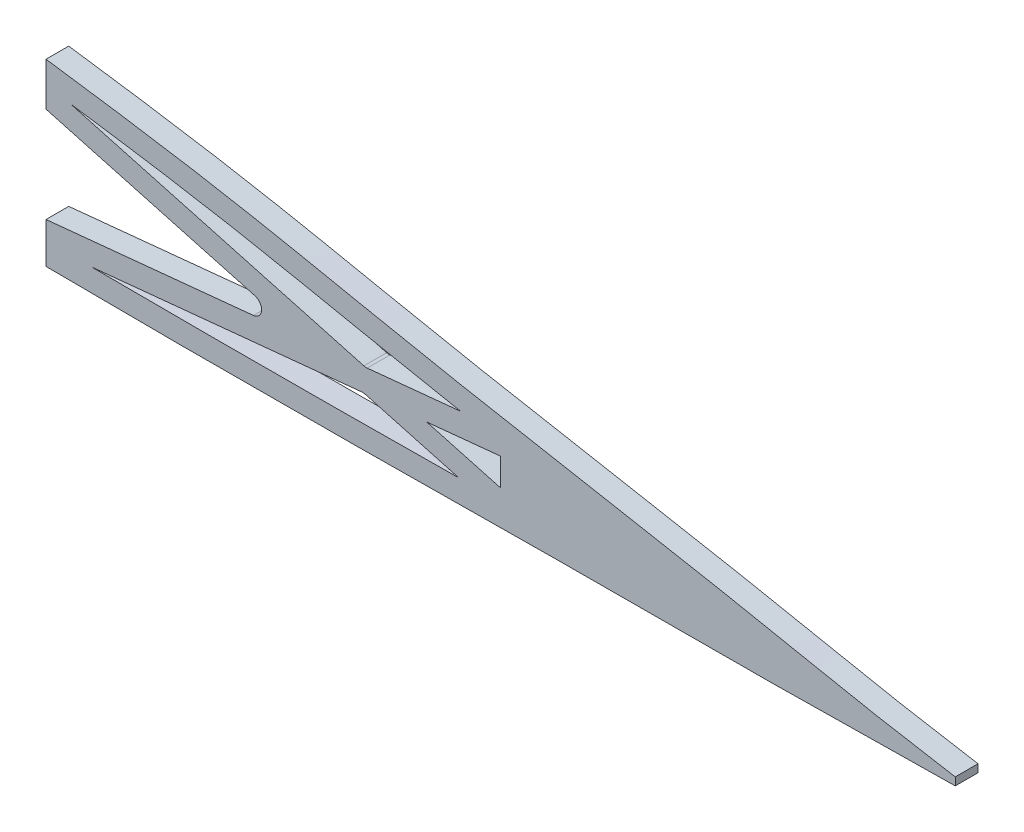
ISO-10303-21;
HEADER;
FILE_DESCRIPTION(('STEP AP214'),'2;1');
FILE_NAME('part.step','',(''),(''),'','','');
FILE_SCHEMA(('AUTOMOTIVE_DESIGN { 1 0 10303 214 1 1 1 1 }'));
ENDSEC;
DATA;
#1=APPLICATION_CONTEXT('core data for automotive mechanical design processes');
#2=APPLICATION_PROTOCOL_DEFINITION('international standard','automotive_design',2000,#1);
#3=PRODUCT_CONTEXT('',#1,'mechanical');
#4=PRODUCT('Part','Part','',(#3));
#5=PRODUCT_RELATED_PRODUCT_CATEGORY('part','',(#4));
#6=PRODUCT_DEFINITION_FORMATION('','',#4);
#7=PRODUCT_DEFINITION_CONTEXT('part definition',#1,'design');
#8=PRODUCT_DEFINITION('design','',#6,#7);
#9=PRODUCT_DEFINITION_SHAPE('','',#8);
#10=(LENGTH_UNIT() NAMED_UNIT(*) SI_UNIT(.MILLI.,.METRE.));
#11=(NAMED_UNIT(*) PLANE_ANGLE_UNIT() SI_UNIT($,.RADIAN.));
#12=(NAMED_UNIT(*) SI_UNIT($,.STERADIAN.) SOLID_ANGLE_UNIT());
#13=UNCERTAINTY_MEASURE_WITH_UNIT(LENGTH_MEASURE(1.E-05),#10,'distance_accuracy_value','');
#14=(GEOMETRIC_REPRESENTATION_CONTEXT(3) GLOBAL_UNCERTAINTY_ASSIGNED_CONTEXT((#13)) GLOBAL_UNIT_ASSIGNED_CONTEXT((#10,
#11,#12)) REPRESENTATION_CONTEXT('',''));
#15=CARTESIAN_POINT('',(0.,0.,0.));
#16=DIRECTION('',(0.,0.,1.));
#17=DIRECTION('',(1.,0.,0.));
#18=AXIS2_PLACEMENT_3D('',#15,#16,#17);
#19=CARTESIAN_POINT('',(200.,0.,0.));
#20=DIRECTION('',(1.,0.,0.));
#21=DIRECTION('',(0.,0.,-1.));
#22=AXIS2_PLACEMENT_3D('',#19,#20,#21);
#23=PLANE('',#22);
#24=DIRECTION('',(0.,1.,0.));
#25=VECTOR('',#24,1.);
#26=CARTESIAN_POINT('',(200.,7.043837586024,5.));
#27=LINE('',#26,#25);
#28=CARTESIAN_POINT('',(200.,-1.90770409103727,5.));
#29=VERTEX_POINT('',#28);
#30=CARTESIAN_POINT('',(200.,7.03924509381721,5.));
#31=VERTEX_POINT('',#30);
#32=EDGE_CURVE('E330',#29,#31,#27,.T.);
#33=ORIENTED_EDGE('',*,*,#32,.T.);
#34=DIRECTION('',(0.,0.,-1.));
#35=VECTOR('',#34,1.);
#36=CARTESIAN_POINT('',(200.,7.03924509381721,0.));
#37=LINE('',#36,#35);
#38=CARTESIAN_POINT('',(200.,7.03924509381721,0.));
#39=VERTEX_POINT('',#38);
#40=EDGE_CURVE('E40',#31,#39,#37,.T.);
#41=ORIENTED_EDGE('',*,*,#40,.T.);
#42=DIRECTION('',(0.,1.,0.));
#43=VECTOR('',#42,1.);
#44=CARTESIAN_POINT('',(200.,7.043837586024,0.));
#45=LINE('',#44,#43);
#46=CARTESIAN_POINT('',(200.,-1.90770409103727,0.));
#47=VERTEX_POINT('',#46);
#48=EDGE_CURVE('E327',#47,#39,#45,.T.);
#49=ORIENTED_EDGE('',*,*,#48,.F.);
#50=DIRECTION('',(0.,0.,-1.));
#51=VECTOR('',#50,1.);
#52=CARTESIAN_POINT('',(200.,-1.90770409103727,5.));
#53=LINE('',#52,#51);
#54=EDGE_CURVE('E35',#29,#47,#53,.T.);
#55=ORIENTED_EDGE('',*,*,#54,.F.);
#56=EDGE_LOOP('',(#33,#41,#49,#55));
#57=FACE_BOUND('',#56,.T.);
#58=ADVANCED_FACE('F32',(#57),#23,.F.);
#59=CARTESIAN_POINT('',(200.,28.0530698130534,0.));
#60=VERTEX_POINT('',#59);
#61=CARTESIAN_POINT('',(199.999999980524,37.5711893939418,0.));
#62=VERTEX_POINT('',#61);
#63=EDGE_CURVE('E325',#60,#62,#45,.T.);
#64=ORIENTED_EDGE('',*,*,#63,.F.);
#65=DIRECTION('',(0.,0.,1.));
#66=VECTOR('',#65,1.);
#67=CARTESIAN_POINT('',(200.,28.0530698130534,0.));
#68=LINE('',#67,#66);
#69=CARTESIAN_POINT('',(200.,28.0530698130534,5.));
#70=VERTEX_POINT('',#69);
#71=EDGE_CURVE('E11',#60,#70,#68,.T.);
#72=ORIENTED_EDGE('',*,*,#71,.T.);
#73=CARTESIAN_POINT('',(199.999999980524,37.5711893939418,5.));
#74=VERTEX_POINT('',#73);
#75=EDGE_CURVE('E54',#70,#74,#27,.T.);
#76=ORIENTED_EDGE('',*,*,#75,.T.);
#77=DIRECTION('',(0.,0.,-1.));
#78=VECTOR('',#77,1.);
#79=CARTESIAN_POINT('',(200.,37.571189391213,5.));
#80=LINE('',#79,#78);
#81=EDGE_CURVE('E331',#62,#74,#80,.F.);
#82=ORIENTED_EDGE('',*,*,#81,.F.);
#83=EDGE_LOOP('',(#64,#72,#76,#82));
#84=FACE_BOUND('',#83,.T.);
#85=ADVANCED_FACE('F400',(#84),#23,.F.);
#86=CARTESIAN_POINT('',(400.,0.86,5.));
#87=CARTESIAN_POINT('',(393.305200969761,1.99142755040669,5.));
#88=CARTESIAN_POINT('',(379.888054219409,4.25893840661478,5.));
#89=CARTESIAN_POINT('',(353.254467592909,9.83498405388175,5.));
#90=CARTESIAN_POINT('',(319.778282362921,15.9016990449285,5.));
#91=CARTESIAN_POINT('',(279.606581657055,23.2215104734732,5.));
#92=CARTESIAN_POINT('',(239.749084042503,31.8228169360915,5.));
#93=CARTESIAN_POINT('',(199.582528596392,37.7218975615089,5.));
#94=CARTESIAN_POINT('',(159.575958445031,43.0450651023344,5.));
#95=CARTESIAN_POINT('',(119.38948583214,43.2860222284759,5.));
#96=CARTESIAN_POINT('',(85.9323003627734,41.5114784156984,5.));
#97=CARTESIAN_POINT('',(59.3734981217757,37.1058365434409,5.));
#98=CARTESIAN_POINT('',(42.4639414852355,33.5766206109549,5.));
#99=CARTESIAN_POINT('',(29.3854656327509,27.8637243258005,5.));
#100=CARTESIAN_POINT('',(19.3178187984093,22.4722217471976,5.));
#101=CARTESIAN_POINT('',(10.8827558349478,16.3887875669979,5.));
#102=CARTESIAN_POINT('',(3.93495223261592,9.56118653744447,5.));
#103=CARTESIAN_POINT('',(-2.75756496559743,1.03970412367404,5.));
#104=CARTESIAN_POINT('',(4.17555573954822,-6.01546626962182,5.));
#105=CARTESIAN_POINT('',(11.7526832410801,-6.40289821774636,5.));
#106=CARTESIAN_POINT('',(20.0895265549785,-5.97846616902742,5.));
#107=CARTESIAN_POINT('',(30.0691693906292,-5.11730792526454,5.));
#108=CARTESIAN_POINT('',(43.3831845646684,-4.18369625072396,5.));
#109=CARTESIAN_POINT('',(60.0439860951753,-3.42405578167953,5.));
#110=CARTESIAN_POINT('',(86.6955135899485,-2.40177217003834,5.));
#111=CARTESIAN_POINT('',(120.021494479284,-1.64515397548607,5.));
#112=CARTESIAN_POINT('',(160.025517699974,-1.28235968805552,5.));
#113=CARTESIAN_POINT('',(200.023820480916,-2.00949740140305,5.));
#114=CARTESIAN_POINT('',(240.02816442434,-2.12748366445573,5.));
#115=CARTESIAN_POINT('',(280.026138396921,-1.93656875711633,5.));
#116=CARTESIAN_POINT('',(320.021358669628,-1.40635764751217,5.));
#117=CARTESIAN_POINT('',(353.35376652875,-1.57269368552499,5.));
#118=CARTESIAN_POINT('',(380.011903847922,-1.12398479042677,5.));
#119=CARTESIAN_POINT('',(393.338634368235,-0.947977323947112,5.));
#120=CARTESIAN_POINT('',(400.,-0.86,5.));
#121=B_SPLINE_CURVE_WITH_KNOTS('',3,(#86,#87,#88,#89,#90,#91,#92,#93,#94,#95,#96,#97,#98,#99,
#100,#101,#102,#103,#104,#105,#106,#107,#108,#109,#110,#111,#112,#113,#114,#115,#116,#117,#118,
#119,#120),.UNSPECIFIED.,.F.,.F.,(4,1,1,1,1,1,1,1,1,1,1,1,1,1,1,1,1,1,1,1,1,1,1,1,1,1,1,1,1,1,1,
1,4),(0.,0.0248295773829765,0.0497613269631987,0.0995049965705522,0.149248666177906,
0.199103599981432,0.248559965552503,0.297717772308088,0.346503417595012,0.395330606156916,
0.419968930729442,0.445007851211111,0.458170616036537,0.471959979106409,0.486919665832551,
0.495371230052362,0.509218186986135,0.518334927016012,0.524512280228655,0.53670542331738,
0.548918460827883,0.561124671111155,0.585522220066046,0.609906958704101,0.658670148191845,
0.707430288578332,0.756206934016985,0.804971253367168,0.853735728028721,0.902491752984366,
0.951255847290666,0.975635237531629,1.),.UNSPECIFIED.);
#122=DIRECTION('',(0.,0.,-1.));
#123=VECTOR('',#122,1.);
#124=SURFACE_OF_LINEAR_EXTRUSION('',#121,#123);
#125=CARTESIAN_POINT('',(400.,0.86,0.));
#126=CARTESIAN_POINT('',(393.305200969761,1.99142755040669,0.));
#127=CARTESIAN_POINT('',(379.888054219409,4.25893840661478,0.));
#128=CARTESIAN_POINT('',(353.254467592909,9.83498405388175,0.));
#129=CARTESIAN_POINT('',(319.778282362921,15.9016990449285,0.));
#130=CARTESIAN_POINT('',(279.606581657055,23.2215104734732,0.));
#131=CARTESIAN_POINT('',(239.749084042503,31.8228169360915,0.));
#132=CARTESIAN_POINT('',(199.582528596392,37.7218975615089,0.));
#133=CARTESIAN_POINT('',(159.575958445031,43.0450651023344,0.));
#134=CARTESIAN_POINT('',(119.38948583214,43.2860222284759,0.));
#135=CARTESIAN_POINT('',(85.9323003627734,41.5114784156984,0.));
#136=CARTESIAN_POINT('',(59.3734981217757,37.1058365434409,0.));
#137=CARTESIAN_POINT('',(42.4639414852355,33.5766206109549,0.));
#138=CARTESIAN_POINT('',(29.3854656327509,27.8637243258005,0.));
#139=CARTESIAN_POINT('',(19.3178187984093,22.4722217471976,0.));
#140=CARTESIAN_POINT('',(10.8827558349478,16.3887875669979,0.));
#141=CARTESIAN_POINT('',(3.93495223261592,9.56118653744447,0.));
#142=CARTESIAN_POINT('',(-2.75756496559743,1.03970412367404,0.));
#143=CARTESIAN_POINT('',(4.17555573954822,-6.01546626962182,0.));
#144=CARTESIAN_POINT('',(11.7526832410801,-6.40289821774636,0.));
#145=CARTESIAN_POINT('',(20.0895265549785,-5.97846616902742,0.));
#146=CARTESIAN_POINT('',(30.0691693906292,-5.11730792526454,0.));
#147=CARTESIAN_POINT('',(43.3831845646684,-4.18369625072396,0.));
#148=CARTESIAN_POINT('',(60.0439860951753,-3.42405578167953,0.));
#149=CARTESIAN_POINT('',(86.6955135899485,-2.40177217003834,0.));
#150=CARTESIAN_POINT('',(120.021494479284,-1.64515397548607,0.));
#151=CARTESIAN_POINT('',(160.025517699974,-1.28235968805552,0.));
#152=CARTESIAN_POINT('',(200.023820480916,-2.00949740140305,0.));
#153=CARTESIAN_POINT('',(240.02816442434,-2.12748366445573,0.));
#154=CARTESIAN_POINT('',(280.026138396921,-1.93656875711633,0.));
#155=CARTESIAN_POINT('',(320.021358669628,-1.40635764751217,0.));
#156=CARTESIAN_POINT('',(353.35376652875,-1.57269368552499,0.));
#157=CARTESIAN_POINT('',(380.011903847922,-1.12398479042677,0.));
#158=CARTESIAN_POINT('',(393.338634368235,-0.947977323947112,0.));
#159=CARTESIAN_POINT('',(400.,-0.86,0.));
#160=B_SPLINE_CURVE_WITH_KNOTS('',3,(#125,#126,#127,#128,#129,#130,#131,#132,#133,#134,#135,
#136,#137,#138,#139,#140,#141,#142,#143,#144,#145,#146,#147,#148,#149,#150,#151,#152,#153,#154,
#155,#156,#157,#158,#159),.UNSPECIFIED.,.F.,.F.,(4,1,1,1,1,1,1,1,1,1,1,1,1,1,1,1,1,1,1,1,1,1,1,
1,1,1,1,1,1,1,1,1,4),(0.,0.0248295773829765,0.0497613269631987,0.0995049965705522,
0.149248666177906,0.199103599981432,0.248559965552503,0.297717772308088,0.346503417595012,
0.395330606156916,0.419968930729442,0.445007851211111,0.458170616036537,0.471959979106409,
0.486919665832551,0.495371230052362,0.509218186986135,0.518334927016012,0.524512280228655,
0.53670542331738,0.548918460827883,0.561124671111155,0.585522220066046,0.609906958704101,
0.658670148191845,0.707430288578332,0.756206934016985,0.804971253367168,0.853735728028721,
0.902491752984366,0.951255847290666,0.975635237531629,1.),.UNSPECIFIED.);
#161=CARTESIAN_POINT('',(400.,0.86,0.));
#162=VERTEX_POINT('',#161);
#163=EDGE_CURVE('E273',#162,#62,#160,.T.);
#164=ORIENTED_EDGE('',*,*,#163,.T.);
#165=ORIENTED_EDGE('',*,*,#81,.T.);
#166=CARTESIAN_POINT('',(400.,0.86,5.));
#167=VERTEX_POINT('',#166);
#168=EDGE_CURVE('E259',#167,#74,#121,.T.);
#169=ORIENTED_EDGE('',*,*,#168,.F.);
#170=DIRECTION('',(0.,0.,-1.));
#171=VECTOR('',#170,1.);
#172=CARTESIAN_POINT('',(400.,0.86,5.));
#173=LINE('',#172,#171);
#174=EDGE_CURVE('E272',#167,#162,#173,.T.);
#175=ORIENTED_EDGE('',*,*,#174,.T.);
#176=EDGE_LOOP('',(#164,#165,#169,#175));
#177=FACE_BOUND('',#176,.T.);
#178=ADVANCED_FACE('F256',(#177),#124,.F.);
#179=CARTESIAN_POINT('',(299.035331138625,14.6268160741621,0.));
#180=CARTESIAN_POINT('',(292.682918130848,15.8093818862015,0.));
#181=CARTESIAN_POINT('',(279.986265855587,18.2216244621528,0.));
#182=CARTESIAN_POINT('',(261.001524003361,22.1361874256996,0.));
#183=CARTESIAN_POINT('',(242.147384699483,25.9336635552651,0.));
#184=CARTESIAN_POINT('',(223.262132370369,29.157945257666,0.));
#185=CARTESIAN_POINT('',(204.204026754886,31.950443940324,0.));
#186=CARTESIAN_POINT('',(185.077851194747,34.6197888598386,0.));
#187=CARTESIAN_POINT('',(166.069831520559,36.8372981966706,0.));
#188=CARTESIAN_POINT('',(147.103727780763,38.0000915465113,0.));
#189=CARTESIAN_POINT('',(127.973344322435,38.1362911760349,0.));
#190=CARTESIAN_POINT('',(108.748796247002,37.6624480648246,0.));
#191=CARTESIAN_POINT('',(92.8690039125347,36.6730460642672,0.));
#192=CARTESIAN_POINT('',(80.2916679928894,35.3040492043498,0.));
#193=CARTESIAN_POINT('',(70.9073643558579,33.9444623574548,0.));
#194=CARTESIAN_POINT('',(61.4815374215166,32.2984396693507,0.));
#195=CARTESIAN_POINT('',(52.1124028956017,30.4860674746299,0.));
#196=CARTESIAN_POINT('',(44.6787404731845,28.5551346576707,0.));
#197=CARTESIAN_POINT('',(39.0191043655183,26.5401848451985,0.));
#198=CARTESIAN_POINT('',(34.7955891399546,24.7499639340872,0.));
#199=CARTESIAN_POINT('',(30.5859005956367,22.7500753301868,0.));
#200=CARTESIAN_POINT('',(26.4921782912631,20.6211960287943,0.));
#201=CARTESIAN_POINT('',(22.5283577345136,18.3187979405783,0.));
#202=CARTESIAN_POINT('',(18.6772384215844,15.7932333571335,0.));
#203=CARTESIAN_POINT('',(15.6462403046157,13.5315432734417,0.));
#204=CARTESIAN_POINT('',(13.3836737281658,11.6517497967764,0.));
#205=CARTESIAN_POINT('',(11.7872008858886,10.2185692822072,0.));
#206=CARTESIAN_POINT('',(10.243553885479,8.71443512114425,0.));
#207=CARTESIAN_POINT('',(8.66048476506102,7.0407875568268,0.));
#208=CARTESIAN_POINT('',(7.05502488836856,5.21701068302751,0.));
#209=CARTESIAN_POINT('',(5.7669490305151,3.48490011748763,0.));
#210=CARTESIAN_POINT('',(4.9891007839833,2.00848532962692,0.));
#211=CARTESIAN_POINT('',(4.8507721100005,1.31233958024176,0.));
#212=CARTESIAN_POINT('',(4.86766038179393,1.14605635665188,0.));
#213=CARTESIAN_POINT('',(4.86410778889175,1.11169166848621,0.));
#214=CARTESIAN_POINT('',(5.16639887304542,0.465327926856741,0.));
#215=CARTESIAN_POINT('',(5.94814031811658,-0.286635423849746,0.));
#216=CARTESIAN_POINT('',(6.64870275688099,-0.722057850963071,0.));
#217=CARTESIAN_POINT('',(7.08245121952551,-0.914778801401329,0.));
#218=CARTESIAN_POINT('',(7.59992500732757,-1.06241800904831,0.));
#219=CARTESIAN_POINT('',(8.30223686090707,-1.17504510759262,0.));
#220=CARTESIAN_POINT('',(9.1808768627137,-1.23955679561765,0.));
#221=CARTESIAN_POINT('',(10.2657289159335,-1.26520660001156,0.));
#222=CARTESIAN_POINT('',(11.4123924888159,-1.27405202291556,0.));
#223=CARTESIAN_POINT('',(12.9282743791984,-1.26295888906647,0.));
#224=CARTESIAN_POINT('',(14.8440427468195,-1.21093092016361,0.));
#225=CARTESIAN_POINT('',(17.1643670405053,-1.09927037140642,0.));
#226=CARTESIAN_POINT('',(20.298544384493,-0.901176789637262,0.));
#227=CARTESIAN_POINT('',(24.2680046374866,-0.597314002796502,0.));
#228=CARTESIAN_POINT('',(29.0898589709367,-0.200210542203632,0.));
#229=CARTESIAN_POINT('',(33.955693631739,0.166807515168344,0.));
#230=CARTESIAN_POINT('',(40.4335072260625,0.603296530220523,0.));
#231=CARTESIAN_POINT('',(48.5343443356036,1.0520336934546,0.));
#232=CARTESIAN_POINT('',(58.2235870528319,1.48584263837947,0.));
#233=CARTESIAN_POINT('',(67.8940960179546,1.87964569912722,0.));
#234=CARTESIAN_POINT('',(77.5751488761833,2.23590199296134,0.));
#235=CARTESIAN_POINT('',(90.4870776539441,2.64657087938945,0.));
#236=CARTESIAN_POINT('',(106.625123431567,3.04406052156369,0.));
#237=CARTESIAN_POINT('',(125.983142294263,3.37549447127149,0.));
#238=CARTESIAN_POINT('',(145.354124554947,3.57080464900245,0.));
#239=CARTESIAN_POINT('',(164.752476969993,3.5455872320248,0.));
#240=CARTESIAN_POINT('',(184.112046368981,3.29176996306967,0.));
#241=CARTESIAN_POINT('',(203.409283461673,3.03381883213432,0.));
#242=CARTESIAN_POINT('',(222.703153334166,2.92486718063442,0.));
#243=CARTESIAN_POINT('',(242.010660857041,2.91425673971068,0.));
#244=CARTESIAN_POINT('',(261.321601831082,2.97526323476208,0.));
#245=CARTESIAN_POINT('',(280.622264812033,3.11273633685657,0.));
#246=CARTESIAN_POINT('',(293.509351287969,3.25603557291985,0.));
#247=CARTESIAN_POINT('',(299.950410362096,3.31992067247559,0.));
#248=B_SPLINE_CURVE_WITH_KNOTS('',3,(#179,#180,#181,#182,#183,#184,#185,#186,#187,#188,#189,
#190,#191,#192,#193,#194,#195,#196,#197,#198,#199,#200,#201,#202,#203,#204,#205,#206,#207,#208,
#209,#210,#211,#212,#213,#214,#215,#216,#217,#218,#219,#220,#221,#222,#223,#224,#225,#226,#227,
#228,#229,#230,#231,#232,#233,#234,#235,#236,#237,#238,#239,#240,#241,#242,#243,#244,#245,#246,
#247),.UNSPECIFIED.,.F.,.F.,(4,1,1,1,1,1,1,1,1,1,1,1,1,1,1,1,1,1,1,1,1,1,1,1,1,1,1,1,1,1,1,1,1,
1,1,1,1,1,1,1,1,1,1,1,1,1,1,1,1,1,1,1,1,1,1,1,1,1,1,1,1,1,1,1,1,1,4),(0.124081866195355,
0.14764445360149,0.171207041007624,0.194769628413758,0.218332215819892,0.241894803226026,
0.26545739063216,0.289019978038295,0.312582565444429,0.336145152850563,0.359707740256697,
0.383270327662831,0.395051621365898,0.406832915068965,0.418614208772032,0.4303955024751,
0.442176796178167,0.4480674430297,0.453958089881234,0.459848736732767,0.465739383584301,
0.471630030435834,0.477520677287368,0.483411324138901,0.486356647564668,0.489301970990435,
0.492247294416202,0.495192617841969,0.498137941267735,0.501083264693502,0.504028588119269,
0.506973911545036,0.508446573257919,0.509919234970802,0.512864558396569,0.515809881822336,
0.517282543535219,0.518755205248103,0.520227866960986,0.521700528673869,0.523173190386753,
0.524645852099636,0.52611851381252,0.527591175525403,0.53053649895117,0.533481822376937,
0.536427145802703,0.542317792654237,0.54820843950577,0.554099086357304,0.559989733208837,
0.571771026911905,0.583552320614972,0.595333614318039,0.607114908021106,0.618896201724173,
0.642458789130307,0.666021376536441,0.689583963942575,0.71314655134871,0.736709138754844,
0.760271726160978,0.783834313567112,0.807396900973246,0.83095948837938,0.854522075785514,
0.878084663191649),.UNSPECIFIED.);
#249=DIRECTION('',(0.,0.,1.));
#250=VECTOR('',#249,1.);
#251=SURFACE_OF_LINEAR_EXTRUSION('',#248,#250);
#252=CARTESIAN_POINT('',(299.035331138625,14.6268160741621,5.));
#253=CARTESIAN_POINT('',(292.682918130848,15.8093818862015,5.));
#254=CARTESIAN_POINT('',(279.986265855587,18.2216244621528,5.));
#255=CARTESIAN_POINT('',(261.001524003361,22.1361874256996,5.));
#256=CARTESIAN_POINT('',(242.147384699483,25.9336635552651,5.));
#257=CARTESIAN_POINT('',(223.262132370369,29.157945257666,5.));
#258=CARTESIAN_POINT('',(204.204026754886,31.950443940324,5.));
#259=CARTESIAN_POINT('',(185.077851194747,34.6197888598386,5.));
#260=CARTESIAN_POINT('',(166.069831520559,36.8372981966706,5.));
#261=CARTESIAN_POINT('',(147.103727780763,38.0000915465113,5.));
#262=CARTESIAN_POINT('',(127.973344322435,38.1362911760349,5.));
#263=CARTESIAN_POINT('',(108.748796247002,37.6624480648246,5.));
#264=CARTESIAN_POINT('',(92.8690039125347,36.6730460642672,5.));
#265=CARTESIAN_POINT('',(80.2916679928894,35.3040492043498,5.));
#266=CARTESIAN_POINT('',(70.9073643558579,33.9444623574548,5.));
#267=CARTESIAN_POINT('',(61.4815374215166,32.2984396693507,5.));
#268=CARTESIAN_POINT('',(52.1124028956017,30.4860674746299,5.));
#269=CARTESIAN_POINT('',(44.6787404731845,28.5551346576707,5.));
#270=CARTESIAN_POINT('',(39.0191043655183,26.5401848451985,5.));
#271=CARTESIAN_POINT('',(34.7955891399546,24.7499639340872,5.));
#272=CARTESIAN_POINT('',(30.5859005956367,22.7500753301868,5.));
#273=CARTESIAN_POINT('',(26.4921782912631,20.6211960287943,5.));
#274=CARTESIAN_POINT('',(22.5283577345136,18.3187979405783,5.));
#275=CARTESIAN_POINT('',(18.6772384215844,15.7932333571335,5.));
#276=CARTESIAN_POINT('',(15.6462403046157,13.5315432734417,5.));
#277=CARTESIAN_POINT('',(13.3836737281658,11.6517497967764,5.));
#278=CARTESIAN_POINT('',(11.7872008858886,10.2185692822072,5.));
#279=CARTESIAN_POINT('',(10.243553885479,8.71443512114425,5.));
#280=CARTESIAN_POINT('',(8.66048476506102,7.0407875568268,5.));
#281=CARTESIAN_POINT('',(7.05502488836856,5.21701068302751,5.));
#282=CARTESIAN_POINT('',(5.7669490305151,3.48490011748763,5.));
#283=CARTESIAN_POINT('',(4.9891007839833,2.00848532962692,5.));
#284=CARTESIAN_POINT('',(4.8507721100005,1.31233958024176,5.));
#285=CARTESIAN_POINT('',(4.86766038179393,1.14605635665188,5.));
#286=CARTESIAN_POINT('',(4.86410778889175,1.11169166848621,5.));
#287=CARTESIAN_POINT('',(5.16639887304542,0.465327926856741,5.));
#288=CARTESIAN_POINT('',(5.94814031811658,-0.286635423849746,5.));
#289=CARTESIAN_POINT('',(6.64870275688099,-0.722057850963071,5.));
#290=CARTESIAN_POINT('',(7.08245121952551,-0.914778801401329,5.));
#291=CARTESIAN_POINT('',(7.59992500732757,-1.06241800904831,5.));
#292=CARTESIAN_POINT('',(8.30223686090707,-1.17504510759262,5.));
#293=CARTESIAN_POINT('',(9.1808768627137,-1.23955679561765,5.));
#294=CARTESIAN_POINT('',(10.2657289159335,-1.26520660001156,5.));
#295=CARTESIAN_POINT('',(11.4123924888159,-1.27405202291556,5.));
#296=CARTESIAN_POINT('',(12.9282743791984,-1.26295888906647,5.));
#297=CARTESIAN_POINT('',(14.8440427468195,-1.21093092016361,5.));
#298=CARTESIAN_POINT('',(17.1643670405053,-1.09927037140642,5.));
#299=CARTESIAN_POINT('',(20.298544384493,-0.901176789637262,5.));
#300=CARTESIAN_POINT('',(24.2680046374866,-0.597314002796502,5.));
#301=CARTESIAN_POINT('',(29.0898589709367,-0.200210542203632,5.));
#302=CARTESIAN_POINT('',(33.955693631739,0.166807515168344,5.));
#303=CARTESIAN_POINT('',(40.4335072260625,0.603296530220523,5.));
#304=CARTESIAN_POINT('',(48.5343443356036,1.0520336934546,5.));
#305=CARTESIAN_POINT('',(58.2235870528319,1.48584263837947,5.));
#306=CARTESIAN_POINT('',(67.8940960179546,1.87964569912722,5.));
#307=CARTESIAN_POINT('',(77.5751488761833,2.23590199296134,5.));
#308=CARTESIAN_POINT('',(90.4870776539441,2.64657087938945,5.));
#309=CARTESIAN_POINT('',(106.625123431567,3.04406052156369,5.));
#310=CARTESIAN_POINT('',(125.983142294263,3.37549447127149,5.));
#311=CARTESIAN_POINT('',(145.354124554947,3.57080464900245,5.));
#312=CARTESIAN_POINT('',(164.752476969993,3.5455872320248,5.));
#313=CARTESIAN_POINT('',(184.112046368981,3.29176996306967,5.));
#314=CARTESIAN_POINT('',(203.409283461673,3.03381883213432,5.));
#315=CARTESIAN_POINT('',(222.703153334166,2.92486718063442,5.));
#316=CARTESIAN_POINT('',(242.010660857041,2.91425673971068,5.));
#317=CARTESIAN_POINT('',(261.321601831082,2.97526323476208,5.));
#318=CARTESIAN_POINT('',(280.622264812033,3.11273633685657,5.));
#319=CARTESIAN_POINT('',(293.509351287969,3.25603557291985,5.));
#320=CARTESIAN_POINT('',(299.950410362096,3.31992067247559,5.));
#321=B_SPLINE_CURVE_WITH_KNOTS('',3,(#252,#253,#254,#255,#256,#257,#258,#259,#260,#261,#262,
#263,#264,#265,#266,#267,#268,#269,#270,#271,#272,#273,#274,#275,#276,#277,#278,#279,#280,#281,
#282,#283,#284,#285,#286,#287,#288,#289,#290,#291,#292,#293,#294,#295,#296,#297,#298,#299,#300,
#301,#302,#303,#304,#305,#306,#307,#308,#309,#310,#311,#312,#313,#314,#315,#316,#317,#318,#319,
#320),.UNSPECIFIED.,.F.,.F.,(4,1,1,1,1,1,1,1,1,1,1,1,1,1,1,1,1,1,1,1,1,1,1,1,1,1,1,1,1,1,1,1,1,
1,1,1,1,1,1,1,1,1,1,1,1,1,1,1,1,1,1,1,1,1,1,1,1,1,1,1,1,1,1,1,1,1,4),(0.124081866195355,
0.14764445360149,0.171207041007624,0.194769628413758,0.218332215819892,0.241894803226026,
0.26545739063216,0.289019978038295,0.312582565444429,0.336145152850563,0.359707740256697,
0.383270327662831,0.395051621365898,0.406832915068965,0.418614208772032,0.4303955024751,
0.442176796178167,0.4480674430297,0.453958089881234,0.459848736732767,0.465739383584301,
0.471630030435834,0.477520677287368,0.483411324138901,0.486356647564668,0.489301970990435,
0.492247294416202,0.495192617841969,0.498137941267735,0.501083264693502,0.504028588119269,
0.506973911545036,0.508446573257919,0.509919234970802,0.512864558396569,0.515809881822336,
0.517282543535219,0.518755205248103,0.520227866960986,0.521700528673869,0.523173190386753,
0.524645852099636,0.52611851381252,0.527591175525403,0.53053649895117,0.533481822376937,
0.536427145802703,0.542317792654237,0.54820843950577,0.554099086357304,0.559989733208837,
0.571771026911905,0.583552320614972,0.595333614318039,0.607114908021106,0.618896201724173,
0.642458789130307,0.666021376536441,0.689583963942575,0.71314655134871,0.736709138754844,
0.760271726160978,0.783834313567112,0.807396900973246,0.83095948837938,0.854522075785514,
0.878084663191649),.UNSPECIFIED.);
#322=CARTESIAN_POINT('',(291.200650276596,16.0995304508592,5.));
#323=VERTEX_POINT('',#322);
#324=CARTESIAN_POINT('',(205.42563866439,31.7532656111418,5.));
#325=VERTEX_POINT('',#324);
#326=EDGE_CURVE('E364',#323,#325,#321,.T.);
#327=ORIENTED_EDGE('',*,*,#326,.T.);
#328=DIRECTION('',(0.,0.,1.));
#329=VECTOR('',#328,1.);
#330=CARTESIAN_POINT('',(205.425638646551,31.7532656160188,0.));
#331=LINE('',#330,#329);
#332=CARTESIAN_POINT('',(205.42563866439,31.7532656111418,0.));
#333=VERTEX_POINT('',#332);
#334=EDGE_CURVE('E217',#325,#333,#331,.F.);
#335=ORIENTED_EDGE('',*,*,#334,.T.);
#336=CARTESIAN_POINT('',(291.200650276596,16.0995304508592,0.));
#337=VERTEX_POINT('',#336);
#338=EDGE_CURVE('E221',#337,#333,#248,.T.);
#339=ORIENTED_EDGE('',*,*,#338,.F.);
#340=DIRECTION('',(0.,0.,1.));
#341=VECTOR('',#340,1.);
#342=CARTESIAN_POINT('',(291.200650276594,16.0995304508594,0.));
#343=LINE('',#342,#341);
#344=EDGE_CURVE('E184',#337,#323,#343,.T.);
#345=ORIENTED_EDGE('',*,*,#344,.T.);
#346=EDGE_LOOP('',(#327,#335,#339,#345));
#347=FACE_BOUND('',#346,.T.);
#348=ADVANCED_FACE('F239',(#347),#251,.F.);
#349=CARTESIAN_POINT('',(400.,-0.86,5.));
#350=VERTEX_POINT('',#349);
#351=EDGE_CURVE('E266',#29,#350,#121,.T.);
#352=ORIENTED_EDGE('',*,*,#351,.F.);
#353=ORIENTED_EDGE('',*,*,#54,.T.);
#354=CARTESIAN_POINT('',(400.,-0.86,0.));
#355=VERTEX_POINT('',#354);
#356=EDGE_CURVE('E279',#47,#355,#160,.T.);
#357=ORIENTED_EDGE('',*,*,#356,.T.);
#358=DIRECTION('',(0.,0.,-1.));
#359=VECTOR('',#358,1.);
#360=CARTESIAN_POINT('',(400.,-0.86,5.));
#361=LINE('',#360,#359);
#362=EDGE_CURVE('E286',#350,#355,#361,.T.);
#363=ORIENTED_EDGE('',*,*,#362,.F.);
#364=EDGE_LOOP('',(#352,#353,#357,#363));
#365=FACE_BOUND('',#364,.T.);
#366=ADVANCED_FACE('F250',(#365),#124,.F.);
#367=CARTESIAN_POINT('',(400.,0.86,5.));
#368=DIRECTION('',(-1.,0.,0.));
#369=DIRECTION('',(0.,-1.,0.));
#370=AXIS2_PLACEMENT_3D('',#367,#368,#369);
#371=PLANE('',#370);
#372=DIRECTION('',(0.,1.,0.));
#373=VECTOR('',#372,1.);
#374=CARTESIAN_POINT('',(400.,0.86,0.));
#375=LINE('',#374,#373);
#376=EDGE_CURVE('E278',#355,#162,#375,.T.);
#377=ORIENTED_EDGE('',*,*,#376,.T.);
#378=ORIENTED_EDGE('',*,*,#174,.F.);
#379=DIRECTION('',(0.,1.,0.));
#380=VECTOR('',#379,1.);
#381=CARTESIAN_POINT('',(400.,0.86,5.));
#382=LINE('',#381,#380);
#383=EDGE_CURVE('E265',#350,#167,#382,.T.);
#384=ORIENTED_EDGE('',*,*,#383,.F.);
#385=ORIENTED_EDGE('',*,*,#362,.T.);
#386=EDGE_LOOP('',(#377,#378,#384,#385));
#387=FACE_BOUND('',#386,.T.);
#388=ADVANCED_FACE('F244',(#387),#371,.F.);
#389=CARTESIAN_POINT('',(2.19937268024211,7.043837586024,5.));
#390=DIRECTION('',(0.,0.,1.));
#391=DIRECTION('',(1.,0.,0.));
#392=AXIS2_PLACEMENT_3D('',#389,#390,#391);
#393=PLANE('',#392);
#394=ORIENTED_EDGE('',*,*,#32,.F.);
#395=ORIENTED_EDGE('',*,*,#351,.T.);
#396=ORIENTED_EDGE('',*,*,#383,.T.);
#397=ORIENTED_EDGE('',*,*,#168,.T.);
#398=ORIENTED_EDGE('',*,*,#75,.F.);
#399=DIRECTION('',(0.964602719650827,-0.263707400810496,0.));
#400=VECTOR('',#399,1.);
#401=CARTESIAN_POINT('',(185.645205043551,31.9774477875453,5.));
#402=LINE('',#401,#400);
#403=CARTESIAN_POINT('',(245.950731654751,15.4908535107798,5.));
#404=VERTEX_POINT('',#403);
#405=EDGE_CURVE('E197',#70,#404,#402,.T.);
#406=ORIENTED_EDGE('',*,*,#405,.T.);
#407=CARTESIAN_POINT('',(245.42331685313,13.5616480714781,5.));
#408=DIRECTION('',(0.,0.,1.));
#409=DIRECTION('',(1.,0.,0.));
#410=AXIS2_PLACEMENT_3D('',#407,#408,#409);
#411=CIRCLE('',#410,2.);
#412=CARTESIAN_POINT('',(245.621032638623,11.5714449491393,5.));
#413=VERTEX_POINT('',#412);
#414=EDGE_CURVE('E321',#404,#413,#411,.F.);
#415=ORIENTED_EDGE('',*,*,#414,.T.);
#416=DIRECTION('',(-0.995101561169396,-0.098857892746263,0.));
#417=VECTOR('',#416,1.);
#418=CARTESIAN_POINT('',(256.378293876421,12.6401199660292,5.));
#419=LINE('',#418,#417);
#420=EDGE_CURVE('E199',#413,#31,#419,.T.);
#421=ORIENTED_EDGE('',*,*,#420,.T.);
#422=EDGE_LOOP('',(#394,#395,#396,#397,#398,#406,#415,#421));
#423=FACE_BOUND('',#422,.T.);
#424=DIRECTION('',(-0.995101561169396,-0.0988578927462618,0.));
#425=VECTOR('',#424,1.);
#426=CARTESIAN_POINT('',(299.703265630231,16.9442187414745,5.));
#427=LINE('',#426,#425);
#428=CARTESIAN_POINT('',(270.653338177345,14.0582674732951,5.));
#429=VERTEX_POINT('',#428);
#430=EDGE_CURVE('E210',#323,#429,#427,.T.);
#431=ORIENTED_EDGE('',*,*,#430,.T.);
#432=CARTESIAN_POINT('',(270.455622391852,16.0484705956339,5.));
#433=DIRECTION('',(0.,0.,1.));
#434=DIRECTION('',(1.,0.,0.));
#435=AXIS2_PLACEMENT_3D('',#432,#433,#434);
#436=CIRCLE('',#435,2.);
#437=CARTESIAN_POINT('',(269.928207590231,14.1192651563322,5.));
#438=VERTEX_POINT('',#437);
#439=EDGE_CURVE('E317',#429,#438,#436,.F.);
#440=ORIENTED_EDGE('',*,*,#439,.T.);
#441=DIRECTION('',(-0.964602719650827,0.263707400810496,0.));
#442=VECTOR('',#441,1.);
#443=CARTESIAN_POINT('',(186.963742047604,36.8004613857995,5.));
#444=LINE('',#443,#442);
#445=EDGE_CURVE('E213',#438,#325,#444,.T.);
#446=ORIENTED_EDGE('',*,*,#445,.T.);
#447=ORIENTED_EDGE('',*,*,#326,.F.);
#448=EDGE_LOOP('',(#431,#440,#446,#447));
#449=FACE_BOUND('',#448,.T.);
#450=DIRECTION('',(0.,1.,0.));
#451=VECTOR('',#450,1.);
#452=CARTESIAN_POINT('',(299.950410362096,14.4564648385511,5.));
#453=LINE('',#452,#451);
#454=CARTESIAN_POINT('',(299.950410362096,5.91166123993425,5.));
#455=VERTEX_POINT('',#454);
#456=CARTESIAN_POINT('',(299.950410362096,11.9441584594291,5.));
#457=VERTEX_POINT('',#456);
#458=EDGE_CURVE('E267',#455,#457,#453,.T.);
#459=ORIENTED_EDGE('',*,*,#458,.F.);
#460=DIRECTION('',(-0.964602719650827,0.263707400810495,0.));
#461=VECTOR('',#460,1.);
#462=CARTESIAN_POINT('',(283.765736434649,10.3362997024067,5.));
#463=LINE('',#462,#461);
#464=CARTESIAN_POINT('',(283.765736434649,10.3362997024067,5.));
#465=VERTEX_POINT('',#464);
#466=EDGE_CURVE('E207',#455,#465,#463,.T.);
#467=ORIENTED_EDGE('',*,*,#466,.T.);
#468=DIRECTION('',(0.995101561169396,0.0988578927462626,0.));
#469=VECTOR('',#468,1.);
#470=CARTESIAN_POINT('',(300.197555093962,11.9687109356275,5.));
#471=LINE('',#470,#469);
#472=EDGE_CURVE('E183',#465,#457,#471,.T.);
#473=ORIENTED_EDGE('',*,*,#472,.T.);
#474=EDGE_LOOP('',(#459,#467,#473));
#475=FACE_BOUND('',#474,.T.);
#476=CARTESIAN_POINT('',(209.964881835677,3.00458879648269,5.));
#477=VERTEX_POINT('',#476);
#478=CARTESIAN_POINT('',(290.81274394167,3.22627617308164,5.));
#479=VERTEX_POINT('',#478);
#480=EDGE_CURVE('E220',#477,#479,#321,.T.);
#481=ORIENTED_EDGE('',*,*,#480,.F.);
#482=DIRECTION('',(0.995101561169396,0.0988578927462623,0.));
#483=VECTOR('',#482,1.);
#484=CARTESIAN_POINT('',(269.858900024248,8.95473163343132,5.));
#485=LINE('',#484,#483);
#486=CARTESIAN_POINT('',(269.490692133726,8.91815219514081,5.));
#487=VERTEX_POINT('',#486);
#488=EDGE_CURVE('E202',#477,#487,#485,.T.);
#489=ORIENTED_EDGE('',*,*,#488,.T.);
#490=CARTESIAN_POINT('',(269.688407919218,6.92794907280202,5.));
#491=DIRECTION('',(0.,0.,1.));
#492=DIRECTION('',(1.,0.,0.));
#493=AXIS2_PLACEMENT_3D('',#490,#491,#492);
#494=CIRCLE('',#493,2.);
#495=CARTESIAN_POINT('',(270.215822720839,8.85715451210368,5.));
#496=VERTEX_POINT('',#495);
#497=EDGE_CURVE('E313',#487,#496,#494,.F.);
#498=ORIENTED_EDGE('',*,*,#497,.T.);
#499=DIRECTION('',(0.964602719650827,-0.263707400810497,0.));
#500=VECTOR('',#499,1.);
#501=CARTESIAN_POINT('',(269.858900024248,8.95473163343132,5.));
#502=LINE('',#501,#500);
#503=EDGE_CURVE('E205',#496,#479,#502,.T.);
#504=ORIENTED_EDGE('',*,*,#503,.T.);
#505=EDGE_LOOP('',(#481,#489,#498,#504));
#506=FACE_BOUND('',#505,.T.);
#507=ADVANCED_FACE('F241',(#423,#449,#475,#506),#393,.T.);
#508=CARTESIAN_POINT('',(2.19937268024211,7.043837586024,0.));
#509=DIRECTION('',(0.,0.,1.));
#510=DIRECTION('',(1.,0.,0.));
#511=AXIS2_PLACEMENT_3D('',#508,#509,#510);
#512=PLANE('',#511);
#513=ORIENTED_EDGE('',*,*,#338,.T.);
#514=DIRECTION('',(-0.964602719650827,0.263707400810496,0.));
#515=VECTOR('',#514,1.);
#516=CARTESIAN_POINT('',(186.963742047604,36.8004613857995,0.));
#517=LINE('',#516,#515);
#518=CARTESIAN_POINT('',(269.928207590231,14.1192651563322,0.));
#519=VERTEX_POINT('',#518);
#520=EDGE_CURVE('E185',#519,#333,#517,.T.);
#521=ORIENTED_EDGE('',*,*,#520,.F.);
#522=CARTESIAN_POINT('',(270.455622391852,16.0484705956339,0.));
#523=DIRECTION('',(0.,0.,1.));
#524=DIRECTION('',(1.,0.,0.));
#525=AXIS2_PLACEMENT_3D('',#522,#523,#524);
#526=CIRCLE('',#525,2.);
#527=CARTESIAN_POINT('',(270.653338177345,14.0582674732951,0.));
#528=VERTEX_POINT('',#527);
#529=EDGE_CURVE('E319',#519,#528,#526,.T.);
#530=ORIENTED_EDGE('',*,*,#529,.T.);
#531=DIRECTION('',(-0.995101561169396,-0.0988578927462618,0.));
#532=VECTOR('',#531,1.);
#533=CARTESIAN_POINT('',(299.703265630231,16.9442187414745,0.));
#534=LINE('',#533,#532);
#535=EDGE_CURVE('E190',#337,#528,#534,.T.);
#536=ORIENTED_EDGE('',*,*,#535,.F.);
#537=EDGE_LOOP('',(#513,#521,#530,#536));
#538=FACE_BOUND('',#537,.T.);
#539=DIRECTION('',(-0.964602719650827,0.263707400810495,0.));
#540=VECTOR('',#539,1.);
#541=CARTESIAN_POINT('',(283.765736434649,10.3362997024067,0.));
#542=LINE('',#541,#540);
#543=CARTESIAN_POINT('',(299.950410362096,5.91166123993425,0.));
#544=VERTEX_POINT('',#543);
#545=CARTESIAN_POINT('',(283.765736434649,10.3362997024067,0.));
#546=VERTEX_POINT('',#545);
#547=EDGE_CURVE('E164',#544,#546,#542,.T.);
#548=ORIENTED_EDGE('',*,*,#547,.F.);
#549=DIRECTION('',(0.,1.,0.));
#550=VECTOR('',#549,1.);
#551=CARTESIAN_POINT('',(299.950410362096,14.4564648385511,0.));
#552=LINE('',#551,#550);
#553=CARTESIAN_POINT('',(299.950410362096,11.9441584594291,0.));
#554=VERTEX_POINT('',#553);
#555=EDGE_CURVE('E189',#544,#554,#552,.T.);
#556=ORIENTED_EDGE('',*,*,#555,.T.);
#557=DIRECTION('',(0.995101561169396,0.0988578927462626,0.));
#558=VECTOR('',#557,1.);
#559=CARTESIAN_POINT('',(300.197555093962,11.9687109356275,0.));
#560=LINE('',#559,#558);
#561=EDGE_CURVE('E175',#546,#554,#560,.T.);
#562=ORIENTED_EDGE('',*,*,#561,.F.);
#563=EDGE_LOOP('',(#548,#556,#562));
#564=FACE_BOUND('',#563,.T.);
#565=DIRECTION('',(0.995101561169396,0.0988578927462623,0.));
#566=VECTOR('',#565,1.);
#567=CARTESIAN_POINT('',(269.858900024248,8.95473163343132,0.));
#568=LINE('',#567,#566);
#569=CARTESIAN_POINT('',(209.964881835677,3.00458879648269,0.));
#570=VERTEX_POINT('',#569);
#571=CARTESIAN_POINT('',(269.490692133726,8.91815219514081,0.));
#572=VERTEX_POINT('',#571);
#573=EDGE_CURVE('E347',#570,#572,#568,.T.);
#574=ORIENTED_EDGE('',*,*,#573,.F.);
#575=CARTESIAN_POINT('',(290.81274394167,3.22627617308164,0.));
#576=VERTEX_POINT('',#575);
#577=EDGE_CURVE('E227',#570,#576,#248,.T.);
#578=ORIENTED_EDGE('',*,*,#577,.T.);
#579=DIRECTION('',(0.964602719650827,-0.263707400810497,0.));
#580=VECTOR('',#579,1.);
#581=CARTESIAN_POINT('',(269.858900024248,8.95473163343132,0.));
#582=LINE('',#581,#580);
#583=CARTESIAN_POINT('',(270.215822720839,8.85715451210368,0.));
#584=VERTEX_POINT('',#583);
#585=EDGE_CURVE('E176',#584,#576,#582,.T.);
#586=ORIENTED_EDGE('',*,*,#585,.F.);
#587=CARTESIAN_POINT('',(269.688407919218,6.92794907280202,0.));
#588=DIRECTION('',(0.,0.,1.));
#589=DIRECTION('',(1.,0.,0.));
#590=AXIS2_PLACEMENT_3D('',#587,#588,#589);
#591=CIRCLE('',#590,2.);
#592=EDGE_CURVE('E315',#584,#572,#591,.T.);
#593=ORIENTED_EDGE('',*,*,#592,.T.);
#594=EDGE_LOOP('',(#574,#578,#586,#593));
#595=FACE_BOUND('',#594,.T.);
#596=ORIENTED_EDGE('',*,*,#356,.F.);
#597=ORIENTED_EDGE('',*,*,#48,.T.);
#598=DIRECTION('',(-0.995101561169396,-0.098857892746263,0.));
#599=VECTOR('',#598,1.);
#600=CARTESIAN_POINT('',(256.378293876421,12.6401199660292,0.));
#601=LINE('',#600,#599);
#602=CARTESIAN_POINT('',(245.621032638623,11.5714449491393,0.));
#603=VERTEX_POINT('',#602);
#604=EDGE_CURVE('E342',#603,#39,#601,.T.);
#605=ORIENTED_EDGE('',*,*,#604,.F.);
#606=CARTESIAN_POINT('',(245.42331685313,13.5616480714781,0.));
#607=DIRECTION('',(0.,0.,1.));
#608=DIRECTION('',(1.,0.,0.));
#609=AXIS2_PLACEMENT_3D('',#606,#607,#608);
#610=CIRCLE('',#609,2.);
#611=CARTESIAN_POINT('',(245.950731654751,15.4908535107798,0.));
#612=VERTEX_POINT('',#611);
#613=EDGE_CURVE('E323',#603,#612,#610,.T.);
#614=ORIENTED_EDGE('',*,*,#613,.T.);
#615=DIRECTION('',(0.964602719650827,-0.263707400810496,0.));
#616=VECTOR('',#615,1.);
#617=CARTESIAN_POINT('',(185.645205043551,31.9774477875453,0.));
#618=LINE('',#617,#616);
#619=EDGE_CURVE('E214',#60,#612,#618,.T.);
#620=ORIENTED_EDGE('',*,*,#619,.F.);
#621=ORIENTED_EDGE('',*,*,#63,.T.);
#622=ORIENTED_EDGE('',*,*,#163,.F.);
#623=ORIENTED_EDGE('',*,*,#376,.F.);
#624=EDGE_LOOP('',(#596,#597,#605,#614,#620,#621,#622,#623));
#625=FACE_BOUND('',#624,.T.);
#626=ADVANCED_FACE('F187',(#538,#564,#595,#625),#512,.F.);
#627=ORIENTED_EDGE('',*,*,#480,.T.);
#628=DIRECTION('',(0.,0.,1.));
#629=VECTOR('',#628,1.);
#630=CARTESIAN_POINT('',(290.812743941669,3.22627617308163,0.));
#631=LINE('',#630,#629);
#632=EDGE_CURVE('E295',#479,#576,#631,.F.);
#633=ORIENTED_EDGE('',*,*,#632,.T.);
#634=ORIENTED_EDGE('',*,*,#577,.F.);
#635=DIRECTION('',(0.,0.,1.));
#636=VECTOR('',#635,1.);
#637=CARTESIAN_POINT('',(209.964881816214,3.00458879454616,0.));
#638=LINE('',#637,#636);
#639=EDGE_CURVE('E292',#570,#477,#638,.T.);
#640=ORIENTED_EDGE('',*,*,#639,.T.);
#641=EDGE_LOOP('',(#627,#633,#634,#640));
#642=FACE_BOUND('',#641,.T.);
#643=ADVANCED_FACE('F233',(#642),#251,.F.);
#644=CARTESIAN_POINT('',(299.950410362096,14.4564648385511,0.));
#645=DIRECTION('',(1.,0.,0.));
#646=DIRECTION('',(0.,0.,-1.));
#647=AXIS2_PLACEMENT_3D('',#644,#645,#646);
#648=PLANE('',#647);
#649=ORIENTED_EDGE('',*,*,#458,.T.);
#650=DIRECTION('',(0.,0.,-1.));
#651=VECTOR('',#650,1.);
#652=CARTESIAN_POINT('',(299.950410362096,11.9441584594291,0.));
#653=LINE('',#652,#651);
#654=EDGE_CURVE('E290',#457,#554,#653,.T.);
#655=ORIENTED_EDGE('',*,*,#654,.T.);
#656=ORIENTED_EDGE('',*,*,#555,.F.);
#657=DIRECTION('',(0.,0.,1.));
#658=VECTOR('',#657,1.);
#659=CARTESIAN_POINT('',(299.950410362096,5.91166123993425,0.));
#660=LINE('',#659,#658);
#661=EDGE_CURVE('E171',#544,#455,#660,.T.);
#662=ORIENTED_EDGE('',*,*,#661,.T.);
#663=EDGE_LOOP('',(#649,#655,#656,#662));
#664=FACE_BOUND('',#663,.T.);
#665=ADVANCED_FACE('F237',(#664),#648,.F.);
#666=CARTESIAN_POINT('',(186.963742047604,36.8004613857995,0.));
#667=DIRECTION('',(0.263707400810496,0.964602719650827,0.));
#668=DIRECTION('',(-0.964602719650827,0.263707400810496,0.));
#669=AXIS2_PLACEMENT_3D('',#666,#667,#668);
#670=PLANE('',#669);
#671=ORIENTED_EDGE('',*,*,#445,.F.);
#672=DIRECTION('',(0.,0.,1.));
#673=VECTOR('',#672,1.);
#674=CARTESIAN_POINT('',(269.928207590231,14.1192651563322,0.));
#675=LINE('',#674,#673);
#676=EDGE_CURVE('E306',#438,#519,#675,.F.);
#677=ORIENTED_EDGE('',*,*,#676,.T.);
#678=ORIENTED_EDGE('',*,*,#520,.T.);
#679=ORIENTED_EDGE('',*,*,#334,.F.);
#680=EDGE_LOOP('',(#671,#677,#678,#679));
#681=FACE_BOUND('',#680,.T.);
#682=ADVANCED_FACE('F389',(#681),#670,.T.);
#683=CARTESIAN_POINT('',(299.703265630231,16.9442187414745,0.));
#684=DIRECTION('',(-0.0988578927462618,0.995101561169396,0.));
#685=DIRECTION('',(-0.995101561169396,-0.0988578927462618,0.));
#686=AXIS2_PLACEMENT_3D('',#683,#684,#685);
#687=PLANE('',#686);
#688=ORIENTED_EDGE('',*,*,#535,.T.);
#689=DIRECTION('',(0.,0.,1.));
#690=VECTOR('',#689,1.);
#691=CARTESIAN_POINT('',(270.653338177345,14.0582674732951,5.));
#692=LINE('',#691,#690);
#693=EDGE_CURVE('E303',#528,#429,#692,.T.);
#694=ORIENTED_EDGE('',*,*,#693,.T.);
#695=ORIENTED_EDGE('',*,*,#430,.F.);
#696=ORIENTED_EDGE('',*,*,#344,.F.);
#697=EDGE_LOOP('',(#688,#694,#695,#696));
#698=FACE_BOUND('',#697,.T.);
#699=ADVANCED_FACE('F381',(#698),#687,.T.);
#700=CARTESIAN_POINT('',(269.858900024248,8.95473163343132,0.));
#701=DIRECTION('',(-0.263707400810497,-0.964602719650827,0.));
#702=DIRECTION('',(0.964602719650827,-0.263707400810497,0.));
#703=AXIS2_PLACEMENT_3D('',#700,#701,#702);
#704=PLANE('',#703);
#705=ORIENTED_EDGE('',*,*,#503,.F.);
#706=DIRECTION('',(0.,0.,1.));
#707=VECTOR('',#706,1.);
#708=CARTESIAN_POINT('',(270.215822720839,8.85715451210368,0.));
#709=LINE('',#708,#707);
#710=EDGE_CURVE('E301',#496,#584,#709,.F.);
#711=ORIENTED_EDGE('',*,*,#710,.T.);
#712=ORIENTED_EDGE('',*,*,#585,.T.);
#713=ORIENTED_EDGE('',*,*,#632,.F.);
#714=EDGE_LOOP('',(#705,#711,#712,#713));
#715=FACE_BOUND('',#714,.T.);
#716=ADVANCED_FACE('F356',(#715),#704,.T.);
#717=CARTESIAN_POINT('',(269.858900024248,8.95473163343132,0.));
#718=DIRECTION('',(0.0988578927462623,-0.995101561169396,0.));
#719=DIRECTION('',(0.995101561169396,0.0988578927462623,0.));
#720=AXIS2_PLACEMENT_3D('',#717,#718,#719);
#721=PLANE('',#720);
#722=ORIENTED_EDGE('',*,*,#573,.T.);
#723=DIRECTION('',(0.,0.,1.));
#724=VECTOR('',#723,1.);
#725=CARTESIAN_POINT('',(269.490692133726,8.91815219514081,5.));
#726=LINE('',#725,#724);
#727=EDGE_CURVE('E298',#572,#487,#726,.T.);
#728=ORIENTED_EDGE('',*,*,#727,.T.);
#729=ORIENTED_EDGE('',*,*,#488,.F.);
#730=ORIENTED_EDGE('',*,*,#639,.F.);
#731=EDGE_LOOP('',(#722,#728,#729,#730));
#732=FACE_BOUND('',#731,.T.);
#733=ADVANCED_FACE('F437',(#732),#721,.T.);
#734=CARTESIAN_POINT('',(300.197555093962,11.9687109356275,0.));
#735=DIRECTION('',(0.0988578927462626,-0.995101561169396,0.));
#736=DIRECTION('',(0.995101561169396,0.0988578927462626,0.));
#737=AXIS2_PLACEMENT_3D('',#734,#735,#736);
#738=PLANE('',#737);
#739=ORIENTED_EDGE('',*,*,#654,.F.);
#740=ORIENTED_EDGE('',*,*,#472,.F.);
#741=DIRECTION('',(0.,0.,1.));
#742=VECTOR('',#741,1.);
#743=CARTESIAN_POINT('',(283.765736434649,10.3362997024067,0.));
#744=LINE('',#743,#742);
#745=EDGE_CURVE('E168',#546,#465,#744,.T.);
#746=ORIENTED_EDGE('',*,*,#745,.F.);
#747=ORIENTED_EDGE('',*,*,#561,.T.);
#748=EDGE_LOOP('',(#739,#740,#746,#747));
#749=FACE_BOUND('',#748,.T.);
#750=ADVANCED_FACE('F181',(#749),#738,.T.);
#751=CARTESIAN_POINT('',(283.765736434649,10.3362997024067,0.));
#752=DIRECTION('',(0.263707400810495,0.964602719650827,0.));
#753=DIRECTION('',(-0.964602719650828,0.263707400810495,0.));
#754=AXIS2_PLACEMENT_3D('',#751,#752,#753);
#755=PLANE('',#754);
#756=ORIENTED_EDGE('',*,*,#661,.F.);
#757=ORIENTED_EDGE('',*,*,#547,.T.);
#758=ORIENTED_EDGE('',*,*,#745,.T.);
#759=ORIENTED_EDGE('',*,*,#466,.F.);
#760=EDGE_LOOP('',(#756,#757,#758,#759));
#761=FACE_BOUND('',#760,.T.);
#762=ADVANCED_FACE('F166',(#761),#755,.T.);
#763=CARTESIAN_POINT('',(256.378293876421,12.6401199660292,0.));
#764=DIRECTION('',(-0.098857892746263,0.995101561169396,0.));
#765=DIRECTION('',(-0.995101561169396,-0.098857892746263,0.));
#766=AXIS2_PLACEMENT_3D('',#763,#764,#765);
#767=PLANE('',#766);
#768=ORIENTED_EDGE('',*,*,#40,.F.);
#769=ORIENTED_EDGE('',*,*,#420,.F.);
#770=DIRECTION('',(0.,0.,1.));
#771=VECTOR('',#770,1.);
#772=CARTESIAN_POINT('',(245.621032638623,11.5714449491393,0.));
#773=LINE('',#772,#771);
#774=EDGE_CURVE('E311',#413,#603,#773,.F.);
#775=ORIENTED_EDGE('',*,*,#774,.T.);
#776=ORIENTED_EDGE('',*,*,#604,.T.);
#777=EDGE_LOOP('',(#768,#769,#775,#776));
#778=FACE_BOUND('',#777,.T.);
#779=ADVANCED_FACE('F343',(#778),#767,.T.);
#780=CARTESIAN_POINT('',(185.645205043551,31.9774477875453,0.));
#781=DIRECTION('',(-0.263707400810496,-0.964602719650827,0.));
#782=DIRECTION('',(0.964602719650827,-0.263707400810496,0.));
#783=AXIS2_PLACEMENT_3D('',#780,#781,#782);
#784=PLANE('',#783);
#785=ORIENTED_EDGE('',*,*,#71,.F.);
#786=ORIENTED_EDGE('',*,*,#619,.T.);
#787=DIRECTION('',(0.,0.,1.));
#788=VECTOR('',#787,1.);
#789=CARTESIAN_POINT('',(245.950731654751,15.4908535107798,5.));
#790=LINE('',#789,#788);
#791=EDGE_CURVE('E308',#612,#404,#790,.T.);
#792=ORIENTED_EDGE('',*,*,#791,.T.);
#793=ORIENTED_EDGE('',*,*,#405,.F.);
#794=EDGE_LOOP('',(#785,#786,#792,#793));
#795=FACE_BOUND('',#794,.T.);
#796=ADVANCED_FACE('F422',(#795),#784,.T.);
#797=CARTESIAN_POINT('',(269.688407919218,6.92794907280202,0.));
#798=DIRECTION('',(0.,0.,-1.));
#799=DIRECTION('',(-1.,0.,0.));
#800=AXIS2_PLACEMENT_3D('',#797,#798,#799);
#801=CYLINDRICAL_SURFACE('',#800,2.);
#802=ORIENTED_EDGE('',*,*,#592,.F.);
#803=ORIENTED_EDGE('',*,*,#710,.F.);
#804=ORIENTED_EDGE('',*,*,#497,.F.);
#805=ORIENTED_EDGE('',*,*,#727,.F.);
#806=EDGE_LOOP('',(#802,#803,#804,#805));
#807=FACE_BOUND('',#806,.T.);
#808=ADVANCED_FACE('F257',(#807),#801,.F.);
#809=CARTESIAN_POINT('',(270.455622391852,16.0484705956339,0.));
#810=DIRECTION('',(0.,0.,-1.));
#811=DIRECTION('',(-1.,0.,0.));
#812=AXIS2_PLACEMENT_3D('',#809,#810,#811);
#813=CYLINDRICAL_SURFACE('',#812,2.);
#814=ORIENTED_EDGE('',*,*,#529,.F.);
#815=ORIENTED_EDGE('',*,*,#676,.F.);
#816=ORIENTED_EDGE('',*,*,#439,.F.);
#817=ORIENTED_EDGE('',*,*,#693,.F.);
#818=EDGE_LOOP('',(#814,#815,#816,#817));
#819=FACE_BOUND('',#818,.T.);
#820=ADVANCED_FACE('F386',(#819),#813,.F.);
#821=CARTESIAN_POINT('',(245.42331685313,13.5616480714781,0.));
#822=DIRECTION('',(0.,0.,-1.));
#823=DIRECTION('',(-1.,0.,0.));
#824=AXIS2_PLACEMENT_3D('',#821,#822,#823);
#825=CYLINDRICAL_SURFACE('',#824,2.);
#826=ORIENTED_EDGE('',*,*,#613,.F.);
#827=ORIENTED_EDGE('',*,*,#774,.F.);
#828=ORIENTED_EDGE('',*,*,#414,.F.);
#829=ORIENTED_EDGE('',*,*,#791,.F.);
#830=EDGE_LOOP('',(#826,#827,#828,#829));
#831=FACE_BOUND('',#830,.T.);
#832=ADVANCED_FACE('F406',(#831),#825,.F.);
#833=CLOSED_SHELL('',(#58,#85,#178,#348,#366,#388,#507,#626,#643,#665,#682,#699,#716,#733,#750,
#762,#779,#796,#808,#820,#832));
#834=MANIFOLD_SOLID_BREP('B2',#833);
#835=ADVANCED_BREP_SHAPE_REPRESENTATION('',(#18,#834),#14);
#836=SHAPE_DEFINITION_REPRESENTATION(#9,#835);
ENDSEC;
END-ISO-10303-21;
